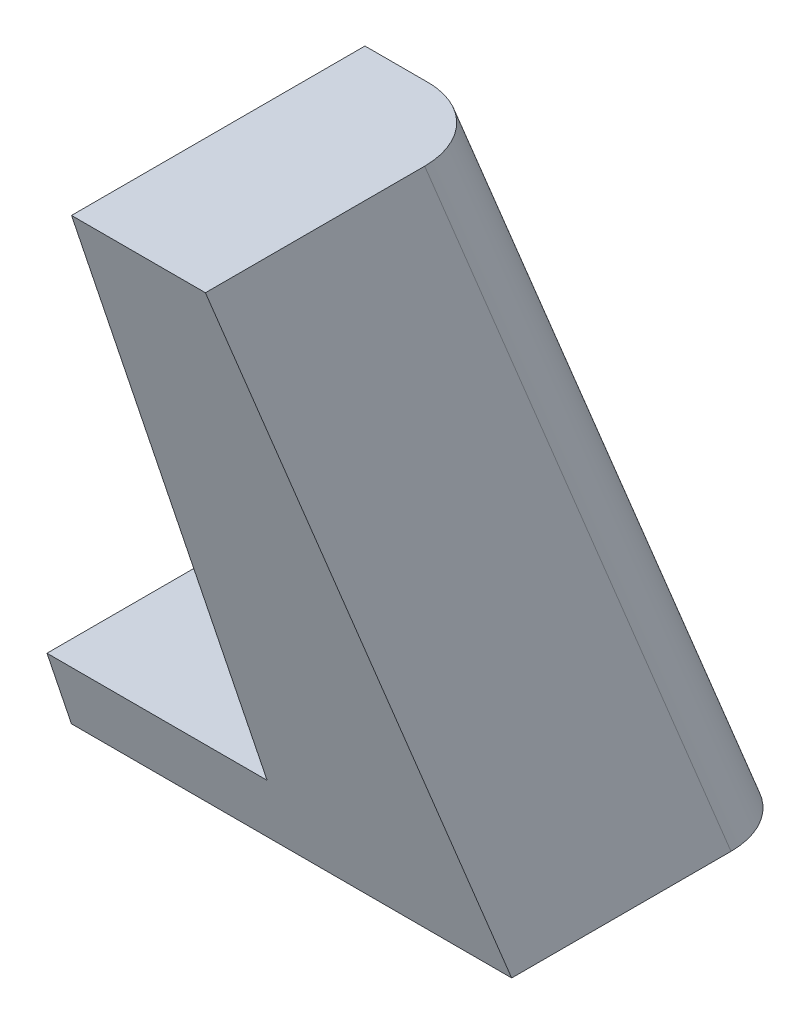
ISO-10303-21;
HEADER;
FILE_DESCRIPTION(('STEP AP214'),'2;1');
FILE_NAME('part.step','',(''),(''),'','','');
FILE_SCHEMA(('AUTOMOTIVE_DESIGN { 1 0 10303 214 1 1 1 1 }'));
ENDSEC;
DATA;
#1=APPLICATION_CONTEXT('core data for automotive mechanical design processes');
#2=APPLICATION_PROTOCOL_DEFINITION('international standard','automotive_design',2000,#1);
#3=PRODUCT_CONTEXT('',#1,'mechanical');
#4=PRODUCT('Part','Part','',(#3));
#5=PRODUCT_RELATED_PRODUCT_CATEGORY('part','',(#4));
#6=PRODUCT_DEFINITION_FORMATION('','',#4);
#7=PRODUCT_DEFINITION_CONTEXT('part definition',#1,'design');
#8=PRODUCT_DEFINITION('design','',#6,#7);
#9=PRODUCT_DEFINITION_SHAPE('','',#8);
#10=(LENGTH_UNIT() NAMED_UNIT(*) SI_UNIT(.MILLI.,.METRE.));
#11=(NAMED_UNIT(*) PLANE_ANGLE_UNIT() SI_UNIT($,.RADIAN.));
#12=(NAMED_UNIT(*) SI_UNIT($,.STERADIAN.) SOLID_ANGLE_UNIT());
#13=UNCERTAINTY_MEASURE_WITH_UNIT(LENGTH_MEASURE(1.E-05),#10,'distance_accuracy_value','');
#14=(GEOMETRIC_REPRESENTATION_CONTEXT(3) GLOBAL_UNCERTAINTY_ASSIGNED_CONTEXT((#13)) GLOBAL_UNIT_ASSIGNED_CONTEXT((#10,
#11,#12)) REPRESENTATION_CONTEXT('',''));
#15=CARTESIAN_POINT('',(0.,0.,0.));
#16=DIRECTION('',(0.,0.,1.));
#17=DIRECTION('',(1.,0.,0.));
#18=AXIS2_PLACEMENT_3D('',#15,#16,#17);
#19=CARTESIAN_POINT('',(39.5460295524683,3.15221063661754,-43.967770335136));
#20=DIRECTION('',(-0.122916675240222,0.941489427371917,0.313829809123973));
#21=DIRECTION('',(0.,-0.316227766016838,0.948683298050514));
#22=AXIS2_PLACEMENT_3D('',#19,#20,#21);
#23=CYLINDRICAL_SURFACE('',#22,5.);
#24=DIRECTION('',(-0.122916675240222,0.941489427371917,0.313829809123973));
#25=VECTOR('',#24,1.);
#26=CARTESIAN_POINT('',(44.5039547778212,3.79949531881639,-43.967770335136));
#27=LINE('',#26,#25);
#28=CARTESIAN_POINT('',(45.,0.,-45.2342687747414));
#29=VERTEX_POINT('',#28);
#30=CARTESIAN_POINT('',(39.125,45.,-30.2342687747414));
#31=VERTEX_POINT('',#30);
#32=EDGE_CURVE('E153',#29,#31,#27,.T.);
#33=ORIENTED_EDGE('',*,*,#32,.F.);
#34=CARTESIAN_POINT('',(39.95756816336,0.,-45.0185072140085));
#35=DIRECTION('',(0.,1.,0.));
#36=DIRECTION('',(-0.364691898216784,0.,0.931128250766262));
#37=AXIS2_PLACEMENT_3D('',#34,#35,#36);
#38=ELLIPSE('',#37,5.31073409284802,5.);
#39=CARTESIAN_POINT('',(41.7980209043926,0.,-50.));
#40=VERTEX_POINT('',#39);
#41=EDGE_CURVE('E43',#40,#29,#38,.F.);
#42=ORIENTED_EDGE('',*,*,#41,.F.);
#43=CARTESIAN_POINT('',(41.9086528378733,-14.9444783579745,-50.));
#44=DIRECTION('',(0.,0.,1.));
#45=DIRECTION('',(-0.12945693643977,0.991585045070583,0.));
#46=AXIS2_PLACEMENT_3D('',#43,#44,#45);
#47=ELLIPSE('',#46,15.932202278544,5.);
#48=CARTESIAN_POINT('',(40.0508147125244,0.866909942867337,-50.));
#49=VERTEX_POINT('',#48);
#50=EDGE_CURVE('E53',#49,#40,#47,.F.);
#51=ORIENTED_EDGE('',*,*,#50,.F.);
#52=DIRECTION('',(-0.122916675240222,0.941489427371918,0.313829809123973));
#53=VECTOR('',#52,1.);
#54=CARTESIAN_POINT('',(38.5691197863116,12.2160625691784,-46.216949124563));
#55=LINE('',#54,#53);
#56=CARTESIAN_POINT('',(34.2889946217321,45.,-35.2889699809558));
#57=VERTEX_POINT('',#56);
#58=EDGE_CURVE('E156',#57,#49,#55,.F.);
#59=ORIENTED_EDGE('',*,*,#58,.F.);
#60=CARTESIAN_POINT('',(34.08256816336,45.,-30.0185072140085));
#61=DIRECTION('',(0.,1.,0.));
#62=DIRECTION('',(-0.364691898216784,0.,0.931128250766262));
#63=AXIS2_PLACEMENT_3D('',#60,#61,#62);
#64=ELLIPSE('',#63,5.31073409284802,5.);
#65=EDGE_CURVE('E11',#31,#57,#64,.T.);
#66=ORIENTED_EDGE('',*,*,#65,.F.);
#67=EDGE_LOOP('',(#33,#42,#51,#59,#66));
#68=FACE_BOUND('',#67,.T.);
#69=ADVANCED_FACE('F36',(#68),#23,.T.);
#70=CARTESIAN_POINT('',(30.,0.,-50.));
#71=DIRECTION('',(1.,0.,0.));
#72=DIRECTION('',(0.,0.,-1.));
#73=AXIS2_PLACEMENT_3D('',#70,#71,#72);
#74=PLANE('',#73);
#75=DIRECTION('',(0.,0.,-1.));
#76=VECTOR('',#75,1.);
#77=CARTESIAN_POINT('',(30.,4.99999999992772,-48.6223033143132));
#78=LINE('',#77,#76);
#79=CARTESIAN_POINT('',(30.,4.99999999992772,-28.622783151911));
#80=VERTEX_POINT('',#79);
#81=CARTESIAN_POINT('',(30.,4.99999999992772,-48.6223033143132));
#82=VERTEX_POINT('',#81);
#83=EDGE_CURVE('E126',#80,#82,#78,.T.);
#84=ORIENTED_EDGE('',*,*,#83,.F.);
#85=DIRECTION('',(0.,-0.948710608132915,-0.316145823973803));
#86=VECTOR('',#85,1.);
#87=CARTESIAN_POINT('',(30.,-5.91194691284608,-32.2590515970235));
#88=LINE('',#87,#86);
#89=CARTESIAN_POINT('',(30.,45.,-15.2932885193357));
#90=VERTEX_POINT('',#89);
#91=EDGE_CURVE('E171',#90,#80,#88,.T.);
#92=ORIENTED_EDGE('',*,*,#91,.F.);
#93=DIRECTION('',(0.,0.,1.));
#94=VECTOR('',#93,1.);
#95=CARTESIAN_POINT('',(30.,45.,-50.));
#96=LINE('',#95,#94);
#97=CARTESIAN_POINT('',(30.,45.,-35.2889699809558));
#98=VERTEX_POINT('',#97);
#99=EDGE_CURVE('E165',#98,#90,#96,.T.);
#100=ORIENTED_EDGE('',*,*,#99,.F.);
#101=DIRECTION('',(0.,-0.948683298050514,-0.316227766016838));
#102=VECTOR('',#101,1.);
#103=CARTESIAN_POINT('',(30.,0.0866909942867337,-50.2600729828602));
#104=LINE('',#103,#102);
#105=EDGE_CURVE('E143',#98,#82,#104,.T.);
#106=ORIENTED_EDGE('',*,*,#105,.T.);
#107=EDGE_LOOP('',(#84,#92,#100,#106));
#108=FACE_BOUND('',#107,.T.);
#109=ADVANCED_FACE('F187',(#108),#74,.F.);
#110=CARTESIAN_POINT('',(0.,45.,-50.));
#111=DIRECTION('',(0.,1.,0.));
#112=DIRECTION('',(0.,0.,1.));
#113=AXIS2_PLACEMENT_3D('',#110,#111,#112);
#114=PLANE('',#113);
#115=DIRECTION('',(0.,0.,1.));
#116=VECTOR('',#115,1.);
#117=CARTESIAN_POINT('',(39.125,45.,-50.));
#118=LINE('',#117,#116);
#119=CARTESIAN_POINT('',(39.125,45.,-15.2932885193357));
#120=VERTEX_POINT('',#119);
#121=EDGE_CURVE('E163',#31,#120,#118,.T.);
#122=ORIENTED_EDGE('',*,*,#121,.F.);
#123=ORIENTED_EDGE('',*,*,#65,.T.);
#124=DIRECTION('',(-1.,0.,0.));
#125=VECTOR('',#124,1.);
#126=CARTESIAN_POINT('',(63.,45.,-35.2889699809558));
#127=LINE('',#126,#125);
#128=EDGE_CURVE('E173',#57,#98,#127,.T.);
#129=ORIENTED_EDGE('',*,*,#128,.T.);
#130=ORIENTED_EDGE('',*,*,#99,.T.);
#131=DIRECTION('',(-1.,0.,0.));
#132=VECTOR('',#131,1.);
#133=CARTESIAN_POINT('',(63.,45.,-15.2932885193357));
#134=LINE('',#133,#132);
#135=EDGE_CURVE('E109',#120,#90,#134,.T.);
#136=ORIENTED_EDGE('',*,*,#135,.F.);
#137=EDGE_LOOP('',(#122,#123,#129,#130,#136));
#138=FACE_BOUND('',#137,.T.);
#139=ADVANCED_FACE('F182',(#138),#114,.T.);
#140=CARTESIAN_POINT('',(44.2458405723433,5.77654029694479,-50.));
#141=DIRECTION('',(-0.991585045070583,-0.12945693643977,0.));
#142=DIRECTION('',(0.12945693643977,-0.991585045070583,0.));
#143=AXIS2_PLACEMENT_3D('',#140,#141,#142);
#144=PLANE('',#143);
#145=DIRECTION('',(0.,0.,1.));
#146=VECTOR('',#145,1.);
#147=CARTESIAN_POINT('',(45.,0.,-50.));
#148=LINE('',#147,#146);
#149=CARTESIAN_POINT('',(45.,-1.76865466716691E-10,-30.2889699810147));
#150=VERTEX_POINT('',#149);
#151=EDGE_CURVE('E104',#29,#150,#148,.T.);
#152=ORIENTED_EDGE('',*,*,#151,.F.);
#153=ORIENTED_EDGE('',*,*,#32,.T.);
#154=ORIENTED_EDGE('',*,*,#121,.T.);
#155=DIRECTION('',(-0.122920160223209,0.94151612085863,0.313748351986139));
#156=VECTOR('',#155,1.);
#157=CARTESIAN_POINT('',(45.0802540777799,-0.614712085122489,-30.4938150169359));
#158=LINE('',#157,#156);
#159=EDGE_CURVE('E108',#150,#120,#158,.T.);
#160=ORIENTED_EDGE('',*,*,#159,.F.);
#161=EDGE_LOOP('',(#152,#153,#154,#160));
#162=FACE_BOUND('',#161,.T.);
#163=ADVANCED_FACE('F162',(#162),#144,.F.);
#164=CARTESIAN_POINT('',(0.,0.,-50.));
#165=DIRECTION('',(0.,1.,0.));
#166=DIRECTION('',(-1.,0.,0.));
#167=AXIS2_PLACEMENT_3D('',#164,#165,#166);
#168=PLANE('',#167);
#169=CARTESIAN_POINT('',(22.5,0.,-38.6225432331121));
#170=DIRECTION('',(0.,1.,0.));
#171=DIRECTION('',(-1.,0.,0.));
#172=AXIS2_PLACEMENT_3D('',#169,#170,#171);
#173=CIRCLE('',#172,2.5);
#174=CARTESIAN_POINT('',(20.,0.,-38.6225432331121));
#175=VERTEX_POINT('',#174);
#176=EDGE_CURVE('E129',#175,#175,#173,.T.);
#177=ORIENTED_EDGE('',*,*,#176,.T.);
#178=EDGE_LOOP('',(#177));
#179=FACE_BOUND('',#178,.T.);
#180=DIRECTION('',(-1.,0.,0.));
#181=VECTOR('',#180,1.);
#182=CARTESIAN_POINT('',(0.,0.,-50.));
#183=LINE('',#182,#181);
#184=CARTESIAN_POINT('',(15.,0.,-50.));
#185=VERTEX_POINT('',#184);
#186=EDGE_CURVE('E159',#40,#185,#183,.T.);
#187=ORIENTED_EDGE('',*,*,#186,.F.);
#188=ORIENTED_EDGE('',*,*,#41,.T.);
#189=ORIENTED_EDGE('',*,*,#151,.T.);
#190=DIRECTION('',(-1.,0.,0.));
#191=VECTOR('',#190,1.);
#192=CARTESIAN_POINT('',(63.,-1.76865466716691E-10,-30.2889699810147));
#193=LINE('',#192,#191);
#194=CARTESIAN_POINT('',(15.,0.,-30.2889699809558));
#195=VERTEX_POINT('',#194);
#196=EDGE_CURVE('E97',#150,#195,#193,.T.);
#197=ORIENTED_EDGE('',*,*,#196,.T.);
#198=DIRECTION('',(0.,0.,1.));
#199=VECTOR('',#198,1.);
#200=CARTESIAN_POINT('',(15.,0.,-30.2889699809558));
#201=LINE('',#200,#199);
#202=EDGE_CURVE('E102',#185,#195,#201,.T.);
#203=ORIENTED_EDGE('',*,*,#202,.F.);
#204=EDGE_LOOP('',(#187,#188,#189,#197,#203));
#205=FACE_BOUND('',#204,.T.);
#206=ADVANCED_FACE('F100',(#179,#205),#168,.F.);
#207=CARTESIAN_POINT('',(0.,0.,-50.));
#208=DIRECTION('',(0.,0.,1.));
#209=DIRECTION('',(1.,0.,0.));
#210=AXIS2_PLACEMENT_3D('',#207,#208,#209);
#211=PLANE('',#210);
#212=DIRECTION('',(1.,0.,0.));
#213=VECTOR('',#212,1.);
#214=CARTESIAN_POINT('',(0.,0.866909942867337,-50.));
#215=LINE('',#214,#213);
#216=CARTESIAN_POINT('',(15.,0.866909942867346,-50.));
#217=VERTEX_POINT('',#216);
#218=EDGE_CURVE('E157',#217,#49,#215,.T.);
#219=ORIENTED_EDGE('',*,*,#218,.T.);
#220=ORIENTED_EDGE('',*,*,#50,.T.);
#221=ORIENTED_EDGE('',*,*,#186,.T.);
#222=DIRECTION('',(0.,-1.,0.));
#223=VECTOR('',#222,1.);
#224=CARTESIAN_POINT('',(15.,0.,-50.));
#225=LINE('',#224,#223);
#226=EDGE_CURVE('E125',#217,#185,#225,.T.);
#227=ORIENTED_EDGE('',*,*,#226,.F.);
#228=EDGE_LOOP('',(#219,#220,#221,#227));
#229=FACE_BOUND('',#228,.T.);
#230=ADVANCED_FACE('F194',(#229),#211,.F.);
#231=CARTESIAN_POINT('',(63.,15.0866909942867,-45.2600729828602));
#232=DIRECTION('',(0.,-0.316227766016838,0.948683298050514));
#233=DIRECTION('',(0.,-0.948683298050514,-0.316227766016838));
#234=AXIS2_PLACEMENT_3D('',#231,#232,#233);
#235=PLANE('',#234);
#236=ORIENTED_EDGE('',*,*,#128,.F.);
#237=ORIENTED_EDGE('',*,*,#58,.T.);
#238=ORIENTED_EDGE('',*,*,#218,.F.);
#239=DIRECTION('',(0.,-0.948683298050513,-0.316227766016839));
#240=VECTOR('',#239,1.);
#241=CARTESIAN_POINT('',(15.,0.866909942867346,-50.));
#242=LINE('',#241,#240);
#243=CARTESIAN_POINT('',(15.,4.99999999992772,-48.6223033143132));
#244=VERTEX_POINT('',#243);
#245=EDGE_CURVE('E135',#244,#217,#242,.T.);
#246=ORIENTED_EDGE('',*,*,#245,.F.);
#247=DIRECTION('',(1.,0.,0.));
#248=VECTOR('',#247,1.);
#249=CARTESIAN_POINT('',(15.,4.99999999992772,-48.6223033143132));
#250=LINE('',#249,#248);
#251=EDGE_CURVE('E138',#244,#82,#250,.T.);
#252=ORIENTED_EDGE('',*,*,#251,.T.);
#253=ORIENTED_EDGE('',*,*,#105,.F.);
#254=EDGE_LOOP('',(#236,#237,#238,#246,#252,#253));
#255=FACE_BOUND('',#254,.T.);
#256=ADVANCED_FACE('F195',(#255),#235,.F.);
#257=CARTESIAN_POINT('',(63.,9.08459793319732,-27.2616424962198));
#258=DIRECTION('',(0.,-0.316145823973803,0.948710608132915));
#259=DIRECTION('',(0.,-0.948710608132915,-0.316145823973803));
#260=AXIS2_PLACEMENT_3D('',#257,#258,#259);
#261=PLANE('',#260);
#262=ORIENTED_EDGE('',*,*,#91,.T.);
#263=DIRECTION('',(1.,0.,0.));
#264=VECTOR('',#263,1.);
#265=CARTESIAN_POINT('',(15.,4.99999999992772,-28.622783151911));
#266=LINE('',#265,#264);
#267=CARTESIAN_POINT('',(15.,4.99999999992772,-28.622783151911));
#268=VERTEX_POINT('',#267);
#269=EDGE_CURVE('E116',#268,#80,#266,.T.);
#270=ORIENTED_EDGE('',*,*,#269,.F.);
#271=DIRECTION('',(0.,0.948710608132915,0.316145823973802));
#272=VECTOR('',#271,1.);
#273=CARTESIAN_POINT('',(15.,4.99999999992772,-28.622783151911));
#274=LINE('',#273,#272);
#275=EDGE_CURVE('E112',#195,#268,#274,.T.);
#276=ORIENTED_EDGE('',*,*,#275,.F.);
#277=ORIENTED_EDGE('',*,*,#196,.F.);
#278=ORIENTED_EDGE('',*,*,#159,.T.);
#279=ORIENTED_EDGE('',*,*,#135,.T.);
#280=EDGE_LOOP('',(#262,#270,#276,#277,#278,#279));
#281=FACE_BOUND('',#280,.T.);
#282=ADVANCED_FACE('F114',(#281),#261,.T.);
#283=CARTESIAN_POINT('',(15.,4.99999999992772,-48.6223033143132));
#284=DIRECTION('',(0.,-1.,0.));
#285=DIRECTION('',(0.,0.,-1.));
#286=AXIS2_PLACEMENT_3D('',#283,#284,#285);
#287=PLANE('',#286);
#288=CARTESIAN_POINT('',(22.5,4.99999999992772,-38.6225432331121));
#289=DIRECTION('',(0.,1.,0.));
#290=DIRECTION('',(0.,0.,1.));
#291=AXIS2_PLACEMENT_3D('',#288,#289,#290);
#292=CIRCLE('',#291,2.5);
#293=CARTESIAN_POINT('',(22.5,4.99999999992772,-36.1225432331121));
#294=VERTEX_POINT('',#293);
#295=EDGE_CURVE('E286',#294,#294,#292,.T.);
#296=ORIENTED_EDGE('',*,*,#295,.F.);
#297=EDGE_LOOP('',(#296));
#298=FACE_BOUND('',#297,.T.);
#299=ORIENTED_EDGE('',*,*,#83,.T.);
#300=ORIENTED_EDGE('',*,*,#251,.F.);
#301=DIRECTION('',(0.,0.,-1.));
#302=VECTOR('',#301,1.);
#303=CARTESIAN_POINT('',(15.,4.99999999992772,-48.6223033143132));
#304=LINE('',#303,#302);
#305=EDGE_CURVE('E119',#268,#244,#304,.T.);
#306=ORIENTED_EDGE('',*,*,#305,.F.);
#307=ORIENTED_EDGE('',*,*,#269,.T.);
#308=EDGE_LOOP('',(#299,#300,#306,#307));
#309=FACE_BOUND('',#308,.T.);
#310=ADVANCED_FACE('F189',(#298,#309),#287,.F.);
#311=CARTESIAN_POINT('',(15.,0.,0.));
#312=DIRECTION('',(1.,0.,0.));
#313=DIRECTION('',(0.,0.,-1.));
#314=AXIS2_PLACEMENT_3D('',#311,#312,#313);
#315=PLANE('',#314);
#316=ORIENTED_EDGE('',*,*,#202,.T.);
#317=ORIENTED_EDGE('',*,*,#275,.T.);
#318=ORIENTED_EDGE('',*,*,#305,.T.);
#319=ORIENTED_EDGE('',*,*,#245,.T.);
#320=ORIENTED_EDGE('',*,*,#226,.T.);
#321=EDGE_LOOP('',(#316,#317,#318,#319,#320));
#322=FACE_BOUND('',#321,.T.);
#323=ADVANCED_FACE('F122',(#322),#315,.F.);
#324=CARTESIAN_POINT('',(22.5,-5.00000000007228,-38.6225432331121));
#325=DIRECTION('',(0.,1.,0.));
#326=DIRECTION('',(0.,0.,1.));
#327=AXIS2_PLACEMENT_3D('',#324,#325,#326);
#328=CYLINDRICAL_SURFACE('',#327,2.5);
#329=ORIENTED_EDGE('',*,*,#295,.T.);
#330=EDGE_LOOP('',(#329));
#331=FACE_BOUND('',#330,.T.);
#332=ORIENTED_EDGE('',*,*,#176,.F.);
#333=EDGE_LOOP('',(#332));
#334=FACE_BOUND('',#333,.T.);
#335=ADVANCED_FACE('F266',(#331,#334),#328,.F.);
#336=CLOSED_SHELL('',(#69,#109,#139,#163,#206,#230,#256,#282,#310,#323,#335));
#337=MANIFOLD_SOLID_BREP('B2',#336);
#338=ADVANCED_BREP_SHAPE_REPRESENTATION('',(#18,#337),#14);
#339=SHAPE_DEFINITION_REPRESENTATION(#9,#338);
ENDSEC;
END-ISO-10303-21;
